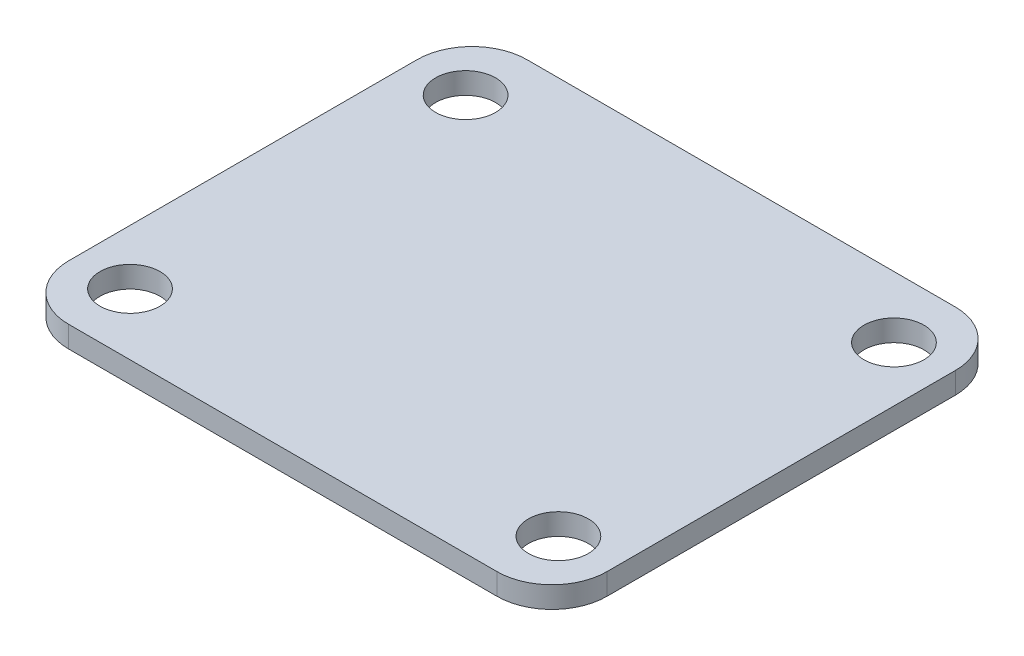
ISO-10303-21;
HEADER;
FILE_DESCRIPTION(('STEP AP214'),'2;1');
FILE_NAME('part.step','',(''),(''),'','','');
FILE_SCHEMA(('AUTOMOTIVE_DESIGN { 1 0 10303 214 1 1 1 1 }'));
ENDSEC;
DATA;
#1=APPLICATION_CONTEXT('core data for automotive mechanical design processes');
#2=APPLICATION_PROTOCOL_DEFINITION('international standard','automotive_design',2000,#1);
#3=PRODUCT_CONTEXT('',#1,'mechanical');
#4=PRODUCT('Part','Part','',(#3));
#5=PRODUCT_RELATED_PRODUCT_CATEGORY('part','',(#4));
#6=PRODUCT_DEFINITION_FORMATION('','',#4);
#7=PRODUCT_DEFINITION_CONTEXT('part definition',#1,'design');
#8=PRODUCT_DEFINITION('design','',#6,#7);
#9=PRODUCT_DEFINITION_SHAPE('','',#8);
#10=(LENGTH_UNIT() NAMED_UNIT(*) SI_UNIT(.MILLI.,.METRE.));
#11=(NAMED_UNIT(*) PLANE_ANGLE_UNIT() SI_UNIT($,.RADIAN.));
#12=(NAMED_UNIT(*) SI_UNIT($,.STERADIAN.) SOLID_ANGLE_UNIT());
#13=UNCERTAINTY_MEASURE_WITH_UNIT(LENGTH_MEASURE(1.E-05),#10,'distance_accuracy_value','');
#14=(GEOMETRIC_REPRESENTATION_CONTEXT(3) GLOBAL_UNCERTAINTY_ASSIGNED_CONTEXT((#13)) GLOBAL_UNIT_ASSIGNED_CONTEXT((#10,
#11,#12)) REPRESENTATION_CONTEXT('',''));
#15=CARTESIAN_POINT('',(0.,0.,0.));
#16=DIRECTION('',(0.,0.,1.));
#17=DIRECTION('',(1.,0.,0.));
#18=AXIS2_PLACEMENT_3D('',#15,#16,#17);
#19=CARTESIAN_POINT('',(0.,0.,0.));
#20=DIRECTION('',(0.,1.,0.));
#21=DIRECTION('',(0.,0.,1.));
#22=AXIS2_PLACEMENT_3D('',#19,#20,#21);
#23=PLANE('',#22);
#24=CARTESIAN_POINT('',(15.,0.,11.75));
#25=DIRECTION('',(0.,1.,0.));
#26=DIRECTION('',(0.,0.,1.));
#27=AXIS2_PLACEMENT_3D('',#24,#25,#26);
#28=CIRCLE('',#27,2.1);
#29=CARTESIAN_POINT('',(15.,0.,13.85));
#30=VERTEX_POINT('',#29);
#31=EDGE_CURVE('E195',#30,#30,#28,.T.);
#32=ORIENTED_EDGE('',*,*,#31,.T.);
#33=EDGE_LOOP('',(#32));
#34=FACE_BOUND('',#33,.T.);
#35=CARTESIAN_POINT('',(15.,0.,-11.75));
#36=DIRECTION('',(0.,1.,0.));
#37=DIRECTION('',(0.,0.,1.));
#38=AXIS2_PLACEMENT_3D('',#35,#36,#37);
#39=CIRCLE('',#38,2.1);
#40=CARTESIAN_POINT('',(15.,0.,-9.65));
#41=VERTEX_POINT('',#40);
#42=EDGE_CURVE('E189',#41,#41,#39,.T.);
#43=ORIENTED_EDGE('',*,*,#42,.T.);
#44=EDGE_LOOP('',(#43));
#45=FACE_BOUND('',#44,.T.);
#46=DIRECTION('',(1.,0.,0.));
#47=VECTOR('',#46,1.);
#48=CARTESIAN_POINT('',(-18.85,0.,16.05));
#49=LINE('',#48,#47);
#50=CARTESIAN_POINT('',(0.,0.,16.05));
#51=VERTEX_POINT('',#50);
#52=CARTESIAN_POINT('',(15.,0.,16.05));
#53=VERTEX_POINT('',#52);
#54=EDGE_CURVE('E116',#51,#53,#49,.T.);
#55=ORIENTED_EDGE('',*,*,#54,.F.);
#56=CARTESIAN_POINT('',(0.,0.,0.));
#57=DIRECTION('',(0.,1.,0.));
#58=DIRECTION('',(0.,0.,1.));
#59=AXIS2_PLACEMENT_3D('',#56,#57,#58);
#60=CIRCLE('',#59,16.05);
#61=CARTESIAN_POINT('',(0.,0.,-16.05));
#62=VERTEX_POINT('',#61);
#63=EDGE_CURVE('E46',#51,#62,#60,.T.);
#64=ORIENTED_EDGE('',*,*,#63,.T.);
#65=DIRECTION('',(-1.,0.,0.));
#66=VECTOR('',#65,1.);
#67=CARTESIAN_POINT('',(-18.85,0.,-16.05));
#68=LINE('',#67,#66);
#69=CARTESIAN_POINT('',(15.,0.,-16.05));
#70=VERTEX_POINT('',#69);
#71=EDGE_CURVE('E114',#70,#62,#68,.T.);
#72=ORIENTED_EDGE('',*,*,#71,.F.);
#73=CARTESIAN_POINT('',(15.,0.,-12.2));
#74=DIRECTION('',(0.,1.,0.));
#75=DIRECTION('',(0.,0.,1.));
#76=AXIS2_PLACEMENT_3D('',#73,#74,#75);
#77=CIRCLE('',#76,3.85);
#78=CARTESIAN_POINT('',(18.85,0.,-12.2));
#79=VERTEX_POINT('',#78);
#80=EDGE_CURVE('E151',#70,#79,#77,.F.);
#81=ORIENTED_EDGE('',*,*,#80,.T.);
#82=DIRECTION('',(0.,0.,-1.));
#83=VECTOR('',#82,1.);
#84=CARTESIAN_POINT('',(18.85,0.,-16.05));
#85=LINE('',#84,#83);
#86=CARTESIAN_POINT('',(18.85,0.,12.2));
#87=VERTEX_POINT('',#86);
#88=EDGE_CURVE('E127',#87,#79,#85,.T.);
#89=ORIENTED_EDGE('',*,*,#88,.F.);
#90=CARTESIAN_POINT('',(15.,0.,12.2));
#91=DIRECTION('',(0.,1.,0.));
#92=DIRECTION('',(0.,0.,1.));
#93=AXIS2_PLACEMENT_3D('',#90,#91,#92);
#94=CIRCLE('',#93,3.85);
#95=EDGE_CURVE('E147',#87,#53,#94,.F.);
#96=ORIENTED_EDGE('',*,*,#95,.T.);
#97=EDGE_LOOP('',(#55,#64,#72,#81,#89,#96));
#98=FACE_BOUND('',#97,.T.);
#99=ADVANCED_FACE('F36',(#34,#45,#98),#23,.F.);
#100=CARTESIAN_POINT('',(0.,1.5,0.));
#101=DIRECTION('',(0.,1.,0.));
#102=DIRECTION('',(0.,0.,1.));
#103=AXIS2_PLACEMENT_3D('',#100,#101,#102);
#104=PLANE('',#103);
#105=CARTESIAN_POINT('',(-15.,1.5,-11.75));
#106=DIRECTION('',(0.,1.,0.));
#107=DIRECTION('',(0.,0.,1.));
#108=AXIS2_PLACEMENT_3D('',#105,#106,#107);
#109=CIRCLE('',#108,2.1);
#110=CARTESIAN_POINT('',(-15.,1.5,-9.65));
#111=VERTEX_POINT('',#110);
#112=EDGE_CURVE('E198',#111,#111,#109,.T.);
#113=ORIENTED_EDGE('',*,*,#112,.F.);
#114=EDGE_LOOP('',(#113));
#115=FACE_BOUND('',#114,.T.);
#116=CARTESIAN_POINT('',(15.,1.5,-11.75));
#117=DIRECTION('',(0.,1.,0.));
#118=DIRECTION('',(0.,0.,1.));
#119=AXIS2_PLACEMENT_3D('',#116,#117,#118);
#120=CIRCLE('',#119,2.1);
#121=CARTESIAN_POINT('',(15.,1.5,-9.65));
#122=VERTEX_POINT('',#121);
#123=EDGE_CURVE('E183',#122,#122,#120,.T.);
#124=ORIENTED_EDGE('',*,*,#123,.F.);
#125=EDGE_LOOP('',(#124));
#126=FACE_BOUND('',#125,.T.);
#127=DIRECTION('',(-1.,0.,0.));
#128=VECTOR('',#127,1.);
#129=CARTESIAN_POINT('',(-18.85,1.5,-16.05));
#130=LINE('',#129,#128);
#131=CARTESIAN_POINT('',(15.,1.5,-16.05));
#132=VERTEX_POINT('',#131);
#133=CARTESIAN_POINT('',(-15.,1.5,-16.05));
#134=VERTEX_POINT('',#133);
#135=EDGE_CURVE('E144',#132,#134,#130,.T.);
#136=ORIENTED_EDGE('',*,*,#135,.T.);
#137=CARTESIAN_POINT('',(-15.,1.5,-12.2));
#138=DIRECTION('',(0.,1.,0.));
#139=DIRECTION('',(0.,0.,1.));
#140=AXIS2_PLACEMENT_3D('',#137,#138,#139);
#141=CIRCLE('',#140,3.85);
#142=CARTESIAN_POINT('',(-18.85,1.5,-12.2));
#143=VERTEX_POINT('',#142);
#144=EDGE_CURVE('E163',#134,#143,#141,.T.);
#145=ORIENTED_EDGE('',*,*,#144,.T.);
#146=DIRECTION('',(0.,0.,1.));
#147=VECTOR('',#146,1.);
#148=CARTESIAN_POINT('',(-18.85,1.5,-16.05));
#149=LINE('',#148,#147);
#150=CARTESIAN_POINT('',(-18.85,1.5,12.2));
#151=VERTEX_POINT('',#150);
#152=EDGE_CURVE('E134',#143,#151,#149,.T.);
#153=ORIENTED_EDGE('',*,*,#152,.T.);
#154=CARTESIAN_POINT('',(-15.,1.5,12.2));
#155=DIRECTION('',(0.,1.,0.));
#156=DIRECTION('',(0.,0.,1.));
#157=AXIS2_PLACEMENT_3D('',#154,#155,#156);
#158=CIRCLE('',#157,3.85);
#159=CARTESIAN_POINT('',(-15.,1.5,16.05));
#160=VERTEX_POINT('',#159);
#161=EDGE_CURVE('E159',#151,#160,#158,.T.);
#162=ORIENTED_EDGE('',*,*,#161,.T.);
#163=DIRECTION('',(1.,0.,0.));
#164=VECTOR('',#163,1.);
#165=CARTESIAN_POINT('',(-18.85,1.5,16.05));
#166=LINE('',#165,#164);
#167=CARTESIAN_POINT('',(15.,1.5,16.05));
#168=VERTEX_POINT('',#167);
#169=EDGE_CURVE('E136',#160,#168,#166,.T.);
#170=ORIENTED_EDGE('',*,*,#169,.T.);
#171=CARTESIAN_POINT('',(15.,1.5,12.2));
#172=DIRECTION('',(0.,1.,0.));
#173=DIRECTION('',(0.,0.,1.));
#174=AXIS2_PLACEMENT_3D('',#171,#172,#173);
#175=CIRCLE('',#174,3.85);
#176=CARTESIAN_POINT('',(18.85,1.5,12.2));
#177=VERTEX_POINT('',#176);
#178=EDGE_CURVE('E157',#168,#177,#175,.T.);
#179=ORIENTED_EDGE('',*,*,#178,.T.);
#180=DIRECTION('',(0.,0.,-1.));
#181=VECTOR('',#180,1.);
#182=CARTESIAN_POINT('',(18.85,1.5,-16.05));
#183=LINE('',#182,#181);
#184=CARTESIAN_POINT('',(18.85,1.5,-12.2));
#185=VERTEX_POINT('',#184);
#186=EDGE_CURVE('E186',#177,#185,#183,.T.);
#187=ORIENTED_EDGE('',*,*,#186,.T.);
#188=CARTESIAN_POINT('',(15.,1.5,-12.2));
#189=DIRECTION('',(0.,1.,0.));
#190=DIRECTION('',(0.,0.,1.));
#191=AXIS2_PLACEMENT_3D('',#188,#189,#190);
#192=CIRCLE('',#191,3.85);
#193=EDGE_CURVE('E161',#185,#132,#192,.T.);
#194=ORIENTED_EDGE('',*,*,#193,.T.);
#195=EDGE_LOOP('',(#136,#145,#153,#162,#170,#179,#187,#194));
#196=FACE_BOUND('',#195,.T.);
#197=CARTESIAN_POINT('',(15.,1.5,11.75));
#198=DIRECTION('',(0.,1.,0.));
#199=DIRECTION('',(0.,0.,1.));
#200=AXIS2_PLACEMENT_3D('',#197,#198,#199);
#201=CIRCLE('',#200,2.1);
#202=CARTESIAN_POINT('',(15.,1.5,13.85));
#203=VERTEX_POINT('',#202);
#204=EDGE_CURVE('E192',#203,#203,#201,.T.);
#205=ORIENTED_EDGE('',*,*,#204,.F.);
#206=EDGE_LOOP('',(#205));
#207=FACE_BOUND('',#206,.T.);
#208=CARTESIAN_POINT('',(-15.,1.5,11.75));
#209=DIRECTION('',(0.,1.,0.));
#210=DIRECTION('',(0.,0.,1.));
#211=AXIS2_PLACEMENT_3D('',#208,#209,#210);
#212=CIRCLE('',#211,2.1);
#213=CARTESIAN_POINT('',(-15.,1.5,13.85));
#214=VERTEX_POINT('',#213);
#215=EDGE_CURVE('E204',#214,#214,#212,.T.);
#216=ORIENTED_EDGE('',*,*,#215,.F.);
#217=EDGE_LOOP('',(#216));
#218=FACE_BOUND('',#217,.T.);
#219=ADVANCED_FACE('F224',(#115,#126,#196,#207,#218),#104,.T.);
#220=CARTESIAN_POINT('',(-15.,0.,-16.05));
#221=VERTEX_POINT('',#220);
#222=EDGE_CURVE('E120',#62,#221,#68,.T.);
#223=ORIENTED_EDGE('',*,*,#222,.F.);
#224=EDGE_CURVE('E11',#62,#51,#60,.T.);
#225=ORIENTED_EDGE('',*,*,#224,.T.);
#226=CARTESIAN_POINT('',(-15.,0.,16.05));
#227=VERTEX_POINT('',#226);
#228=EDGE_CURVE('E176',#227,#51,#49,.T.);
#229=ORIENTED_EDGE('',*,*,#228,.F.);
#230=CARTESIAN_POINT('',(-15.,0.,12.2));
#231=DIRECTION('',(0.,1.,0.));
#232=DIRECTION('',(0.,0.,1.));
#233=AXIS2_PLACEMENT_3D('',#230,#231,#232);
#234=CIRCLE('',#233,3.85);
#235=CARTESIAN_POINT('',(-18.85,0.,12.2));
#236=VERTEX_POINT('',#235);
#237=EDGE_CURVE('E149',#227,#236,#234,.F.);
#238=ORIENTED_EDGE('',*,*,#237,.T.);
#239=DIRECTION('',(0.,0.,1.));
#240=VECTOR('',#239,1.);
#241=CARTESIAN_POINT('',(-18.85,0.,-16.05));
#242=LINE('',#241,#240);
#243=CARTESIAN_POINT('',(-18.85,0.,-12.2));
#244=VERTEX_POINT('',#243);
#245=EDGE_CURVE('E180',#244,#236,#242,.T.);
#246=ORIENTED_EDGE('',*,*,#245,.F.);
#247=CARTESIAN_POINT('',(-15.,0.,-12.2));
#248=DIRECTION('',(0.,1.,0.));
#249=DIRECTION('',(0.,0.,1.));
#250=AXIS2_PLACEMENT_3D('',#247,#248,#249);
#251=CIRCLE('',#250,3.85);
#252=EDGE_CURVE('E124',#244,#221,#251,.F.);
#253=ORIENTED_EDGE('',*,*,#252,.T.);
#254=EDGE_LOOP('',(#223,#225,#229,#238,#246,#253));
#255=FACE_BOUND('',#254,.T.);
#256=CARTESIAN_POINT('',(-15.,0.,-11.75));
#257=DIRECTION('',(0.,1.,0.));
#258=DIRECTION('',(0.,0.,1.));
#259=AXIS2_PLACEMENT_3D('',#256,#257,#258);
#260=CIRCLE('',#259,2.1);
#261=CARTESIAN_POINT('',(-15.,0.,-9.65));
#262=VERTEX_POINT('',#261);
#263=EDGE_CURVE('E201',#262,#262,#260,.T.);
#264=ORIENTED_EDGE('',*,*,#263,.T.);
#265=EDGE_LOOP('',(#264));
#266=FACE_BOUND('',#265,.T.);
#267=CARTESIAN_POINT('',(-15.,0.,11.75));
#268=DIRECTION('',(0.,1.,0.));
#269=DIRECTION('',(0.,0.,1.));
#270=AXIS2_PLACEMENT_3D('',#267,#268,#269);
#271=CIRCLE('',#270,2.1);
#272=CARTESIAN_POINT('',(-15.,0.,13.85));
#273=VERTEX_POINT('',#272);
#274=EDGE_CURVE('E207',#273,#273,#271,.T.);
#275=ORIENTED_EDGE('',*,*,#274,.T.);
#276=EDGE_LOOP('',(#275));
#277=FACE_BOUND('',#276,.T.);
#278=ADVANCED_FACE('F121',(#255,#266,#277),#23,.F.);
#279=CARTESIAN_POINT('',(-18.85,1.5,-16.05));
#280=DIRECTION('',(1.,0.,0.));
#281=DIRECTION('',(0.,0.,-1.));
#282=AXIS2_PLACEMENT_3D('',#279,#280,#281);
#283=PLANE('',#282);
#284=ORIENTED_EDGE('',*,*,#152,.F.);
#285=DIRECTION('',(0.,-1.,0.));
#286=VECTOR('',#285,1.);
#287=CARTESIAN_POINT('',(-18.85,1.5,-12.2));
#288=LINE('',#287,#286);
#289=EDGE_CURVE('E143',#143,#244,#288,.T.);
#290=ORIENTED_EDGE('',*,*,#289,.T.);
#291=ORIENTED_EDGE('',*,*,#245,.T.);
#292=DIRECTION('',(0.,-1.,0.));
#293=VECTOR('',#292,1.);
#294=CARTESIAN_POINT('',(-18.85,1.5,12.2));
#295=LINE('',#294,#293);
#296=EDGE_CURVE('E141',#236,#151,#295,.F.);
#297=ORIENTED_EDGE('',*,*,#296,.T.);
#298=EDGE_LOOP('',(#284,#290,#291,#297));
#299=FACE_BOUND('',#298,.T.);
#300=ADVANCED_FACE('F235',(#299),#283,.F.);
#301=CARTESIAN_POINT('',(-18.85,1.5,16.05));
#302=DIRECTION('',(0.,0.,-1.));
#303=DIRECTION('',(-1.,0.,0.));
#304=AXIS2_PLACEMENT_3D('',#301,#302,#303);
#305=PLANE('',#304);
#306=ORIENTED_EDGE('',*,*,#169,.F.);
#307=DIRECTION('',(0.,-1.,0.));
#308=VECTOR('',#307,1.);
#309=CARTESIAN_POINT('',(-15.,1.5,16.05));
#310=LINE('',#309,#308);
#311=EDGE_CURVE('E40',#160,#227,#310,.T.);
#312=ORIENTED_EDGE('',*,*,#311,.T.);
#313=ORIENTED_EDGE('',*,*,#228,.T.);
#314=ORIENTED_EDGE('',*,*,#54,.T.);
#315=DIRECTION('',(0.,-1.,0.));
#316=VECTOR('',#315,1.);
#317=CARTESIAN_POINT('',(15.,1.5,16.05));
#318=LINE('',#317,#316);
#319=EDGE_CURVE('E168',#53,#168,#318,.F.);
#320=ORIENTED_EDGE('',*,*,#319,.T.);
#321=EDGE_LOOP('',(#306,#312,#313,#314,#320));
#322=FACE_BOUND('',#321,.T.);
#323=ADVANCED_FACE('F175',(#322),#305,.F.);
#324=CARTESIAN_POINT('',(18.85,1.5,-16.05));
#325=DIRECTION('',(-1.,0.,0.));
#326=DIRECTION('',(0.,0.,1.));
#327=AXIS2_PLACEMENT_3D('',#324,#325,#326);
#328=PLANE('',#327);
#329=ORIENTED_EDGE('',*,*,#88,.T.);
#330=DIRECTION('',(0.,-1.,0.));
#331=VECTOR('',#330,1.);
#332=CARTESIAN_POINT('',(18.85,1.5,-12.2));
#333=LINE('',#332,#331);
#334=EDGE_CURVE('E58',#79,#185,#333,.F.);
#335=ORIENTED_EDGE('',*,*,#334,.T.);
#336=ORIENTED_EDGE('',*,*,#186,.F.);
#337=DIRECTION('',(0.,-1.,0.));
#338=VECTOR('',#337,1.);
#339=CARTESIAN_POINT('',(18.85,1.5,12.2));
#340=LINE('',#339,#338);
#341=EDGE_CURVE('E165',#177,#87,#340,.T.);
#342=ORIENTED_EDGE('',*,*,#341,.T.);
#343=EDGE_LOOP('',(#329,#335,#336,#342));
#344=FACE_BOUND('',#343,.T.);
#345=ADVANCED_FACE('F244',(#344),#328,.F.);
#346=CARTESIAN_POINT('',(-18.85,1.5,-16.05));
#347=DIRECTION('',(0.,0.,1.));
#348=DIRECTION('',(1.,0.,0.));
#349=AXIS2_PLACEMENT_3D('',#346,#347,#348);
#350=PLANE('',#349);
#351=ORIENTED_EDGE('',*,*,#71,.T.);
#352=ORIENTED_EDGE('',*,*,#222,.T.);
#353=DIRECTION('',(0.,-1.,0.));
#354=VECTOR('',#353,1.);
#355=CARTESIAN_POINT('',(-15.,1.5,-16.05));
#356=LINE('',#355,#354);
#357=EDGE_CURVE('E155',#221,#134,#356,.F.);
#358=ORIENTED_EDGE('',*,*,#357,.T.);
#359=ORIENTED_EDGE('',*,*,#135,.F.);
#360=DIRECTION('',(0.,-1.,0.));
#361=VECTOR('',#360,1.);
#362=CARTESIAN_POINT('',(15.,1.5,-16.05));
#363=LINE('',#362,#361);
#364=EDGE_CURVE('E133',#132,#70,#363,.T.);
#365=ORIENTED_EDGE('',*,*,#364,.T.);
#366=EDGE_LOOP('',(#351,#352,#358,#359,#365));
#367=FACE_BOUND('',#366,.T.);
#368=ADVANCED_FACE('F130',(#367),#350,.F.);
#369=CARTESIAN_POINT('',(15.,1.5,-11.75));
#370=DIRECTION('',(0.,-1.,0.));
#371=DIRECTION('',(0.,0.,-1.));
#372=AXIS2_PLACEMENT_3D('',#369,#370,#371);
#373=CYLINDRICAL_SURFACE('',#372,2.1);
#374=ORIENTED_EDGE('',*,*,#123,.T.);
#375=EDGE_LOOP('',(#374));
#376=FACE_BOUND('',#375,.T.);
#377=ORIENTED_EDGE('',*,*,#42,.F.);
#378=EDGE_LOOP('',(#377));
#379=FACE_BOUND('',#378,.T.);
#380=ADVANCED_FACE('F276',(#376,#379),#373,.F.);
#381=CARTESIAN_POINT('',(15.,1.5,11.75));
#382=DIRECTION('',(0.,-1.,0.));
#383=DIRECTION('',(0.,0.,-1.));
#384=AXIS2_PLACEMENT_3D('',#381,#382,#383);
#385=CYLINDRICAL_SURFACE('',#384,2.1);
#386=ORIENTED_EDGE('',*,*,#204,.T.);
#387=EDGE_LOOP('',(#386));
#388=FACE_BOUND('',#387,.T.);
#389=ORIENTED_EDGE('',*,*,#31,.F.);
#390=EDGE_LOOP('',(#389));
#391=FACE_BOUND('',#390,.T.);
#392=ADVANCED_FACE('F280',(#388,#391),#385,.F.);
#393=CARTESIAN_POINT('',(-15.,1.5,-11.75));
#394=DIRECTION('',(0.,-1.,0.));
#395=DIRECTION('',(0.,0.,-1.));
#396=AXIS2_PLACEMENT_3D('',#393,#394,#395);
#397=CYLINDRICAL_SURFACE('',#396,2.1);
#398=ORIENTED_EDGE('',*,*,#112,.T.);
#399=EDGE_LOOP('',(#398));
#400=FACE_BOUND('',#399,.T.);
#401=ORIENTED_EDGE('',*,*,#263,.F.);
#402=EDGE_LOOP('',(#401));
#403=FACE_BOUND('',#402,.T.);
#404=ADVANCED_FACE('F286',(#400,#403),#397,.F.);
#405=CARTESIAN_POINT('',(-15.,1.5,11.75));
#406=DIRECTION('',(0.,-1.,0.));
#407=DIRECTION('',(0.,0.,-1.));
#408=AXIS2_PLACEMENT_3D('',#405,#406,#407);
#409=CYLINDRICAL_SURFACE('',#408,2.1);
#410=ORIENTED_EDGE('',*,*,#215,.T.);
#411=EDGE_LOOP('',(#410));
#412=FACE_BOUND('',#411,.T.);
#413=ORIENTED_EDGE('',*,*,#274,.F.);
#414=EDGE_LOOP('',(#413));
#415=FACE_BOUND('',#414,.T.);
#416=ADVANCED_FACE('F253',(#412,#415),#409,.F.);
#417=CARTESIAN_POINT('',(-15.,1.5,-12.2));
#418=DIRECTION('',(0.,-1.,0.));
#419=DIRECTION('',(0.,0.,-1.));
#420=AXIS2_PLACEMENT_3D('',#417,#418,#419);
#421=CYLINDRICAL_SURFACE('',#420,3.85);
#422=ORIENTED_EDGE('',*,*,#144,.F.);
#423=ORIENTED_EDGE('',*,*,#357,.F.);
#424=ORIENTED_EDGE('',*,*,#252,.F.);
#425=ORIENTED_EDGE('',*,*,#289,.F.);
#426=EDGE_LOOP('',(#422,#423,#424,#425));
#427=FACE_BOUND('',#426,.T.);
#428=ADVANCED_FACE('F249',(#427),#421,.T.);
#429=CARTESIAN_POINT('',(15.,1.5,-12.2));
#430=DIRECTION('',(0.,-1.,0.));
#431=DIRECTION('',(0.,0.,-1.));
#432=AXIS2_PLACEMENT_3D('',#429,#430,#431);
#433=CYLINDRICAL_SURFACE('',#432,3.85);
#434=ORIENTED_EDGE('',*,*,#193,.F.);
#435=ORIENTED_EDGE('',*,*,#334,.F.);
#436=ORIENTED_EDGE('',*,*,#80,.F.);
#437=ORIENTED_EDGE('',*,*,#364,.F.);
#438=EDGE_LOOP('',(#434,#435,#436,#437));
#439=FACE_BOUND('',#438,.T.);
#440=ADVANCED_FACE('F252',(#439),#433,.T.);
#441=CARTESIAN_POINT('',(-15.,1.5,12.2));
#442=DIRECTION('',(0.,-1.,0.));
#443=DIRECTION('',(0.,0.,-1.));
#444=AXIS2_PLACEMENT_3D('',#441,#442,#443);
#445=CYLINDRICAL_SURFACE('',#444,3.85);
#446=ORIENTED_EDGE('',*,*,#161,.F.);
#447=ORIENTED_EDGE('',*,*,#296,.F.);
#448=ORIENTED_EDGE('',*,*,#237,.F.);
#449=ORIENTED_EDGE('',*,*,#311,.F.);
#450=EDGE_LOOP('',(#446,#447,#448,#449));
#451=FACE_BOUND('',#450,.T.);
#452=ADVANCED_FACE('F256',(#451),#445,.T.);
#453=CARTESIAN_POINT('',(15.,1.5,12.2));
#454=DIRECTION('',(0.,-1.,0.));
#455=DIRECTION('',(0.,0.,-1.));
#456=AXIS2_PLACEMENT_3D('',#453,#454,#455);
#457=CYLINDRICAL_SURFACE('',#456,3.85);
#458=ORIENTED_EDGE('',*,*,#178,.F.);
#459=ORIENTED_EDGE('',*,*,#319,.F.);
#460=ORIENTED_EDGE('',*,*,#95,.F.);
#461=ORIENTED_EDGE('',*,*,#341,.F.);
#462=EDGE_LOOP('',(#458,#459,#460,#461));
#463=FACE_BOUND('',#462,.T.);
#464=ADVANCED_FACE('F38',(#463),#457,.T.);
#465=CARTESIAN_POINT('',(0.,0.,0.));
#466=DIRECTION('',(0.,1.,0.));
#467=DIRECTION('',(0.,0.,1.));
#468=AXIS2_PLACEMENT_3D('',#465,#466,#467);
#469=CONICAL_SURFACE('',#468,16.05,0.872664625997163);
#470=CARTESIAN_POINT('',(0.,-2.5,0.));
#471=DIRECTION('',(0.,1.,0.));
#472=DIRECTION('',(0.,0.,1.));
#473=AXIS2_PLACEMENT_3D('',#470,#471,#472);
#474=CIRCLE('',#473,13.0706160185145);
#475=CARTESIAN_POINT('',(0.,-2.5,13.0706160185145));
#476=VERTEX_POINT('',#475);
#477=EDGE_CURVE('E118',#476,#476,#474,.T.);
#478=ORIENTED_EDGE('',*,*,#477,.T.);
#479=EDGE_LOOP('',(#478));
#480=FACE_BOUND('',#479,.T.);
#481=ORIENTED_EDGE('',*,*,#63,.F.);
#482=ORIENTED_EDGE('',*,*,#224,.F.);
#483=EDGE_LOOP('',(#481,#482));
#484=FACE_BOUND('',#483,.T.);
#485=ADVANCED_FACE('F106',(#480,#484),#469,.T.);
#486=CARTESIAN_POINT('',(0.,-2.5,0.));
#487=DIRECTION('',(0.,-1.,0.));
#488=DIRECTION('',(0.,0.,-1.));
#489=AXIS2_PLACEMENT_3D('',#486,#487,#488);
#490=PLANE('',#489);
#491=ORIENTED_EDGE('',*,*,#477,.F.);
#492=EDGE_LOOP('',(#491));
#493=FACE_BOUND('',#492,.T.);
#494=ADVANCED_FACE('F216',(#493),#490,.T.);
#495=CLOSED_SHELL('',(#99,#219,#278,#300,#323,#345,#368,#380,#392,#404,#416,#428,#440,#452,#464,
#485,#494));
#496=MANIFOLD_SOLID_BREP('B2',#495);
#497=ADVANCED_BREP_SHAPE_REPRESENTATION('',(#18,#496),#14);
#498=SHAPE_DEFINITION_REPRESENTATION(#9,#497);
ENDSEC;
END-ISO-10303-21;
